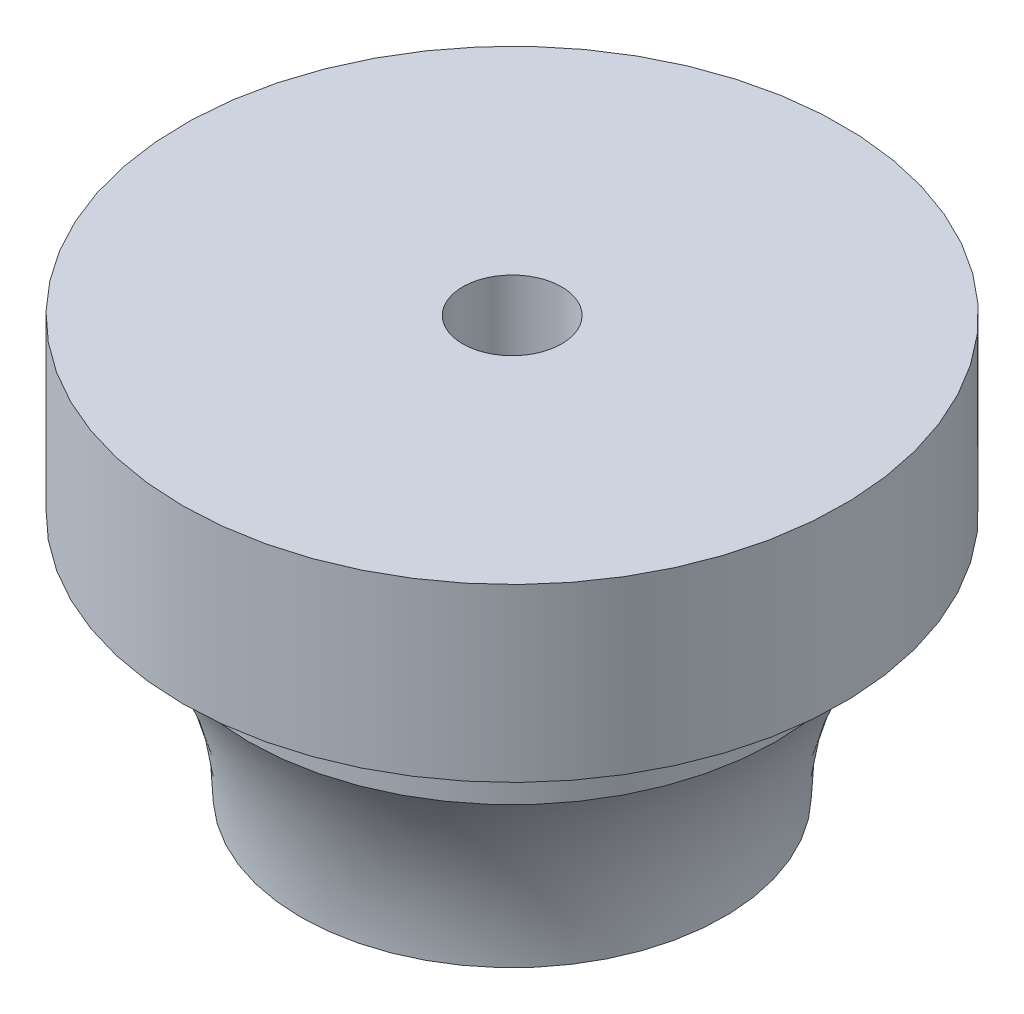
ISO-10303-21;
HEADER;
FILE_DESCRIPTION(('STEP AP214'),'2;1');
FILE_NAME('part.step','',(''),(''),'','','');
FILE_SCHEMA(('AUTOMOTIVE_DESIGN { 1 0 10303 214 1 1 1 1 }'));
ENDSEC;
DATA;
#1=APPLICATION_CONTEXT('core data for automotive mechanical design processes');
#2=APPLICATION_PROTOCOL_DEFINITION('international standard','automotive_design',2000,#1);
#3=PRODUCT_CONTEXT('',#1,'mechanical');
#4=PRODUCT('Part','Part','',(#3));
#5=PRODUCT_RELATED_PRODUCT_CATEGORY('part','',(#4));
#6=PRODUCT_DEFINITION_FORMATION('','',#4);
#7=PRODUCT_DEFINITION_CONTEXT('part definition',#1,'design');
#8=PRODUCT_DEFINITION('design','',#6,#7);
#9=PRODUCT_DEFINITION_SHAPE('','',#8);
#10=(LENGTH_UNIT() NAMED_UNIT(*) SI_UNIT(.MILLI.,.METRE.));
#11=(NAMED_UNIT(*) PLANE_ANGLE_UNIT() SI_UNIT($,.RADIAN.));
#12=(NAMED_UNIT(*) SI_UNIT($,.STERADIAN.) SOLID_ANGLE_UNIT());
#13=UNCERTAINTY_MEASURE_WITH_UNIT(LENGTH_MEASURE(1.E-05),#10,'distance_accuracy_value','');
#14=(GEOMETRIC_REPRESENTATION_CONTEXT(3) GLOBAL_UNCERTAINTY_ASSIGNED_CONTEXT((#13)) GLOBAL_UNIT_ASSIGNED_CONTEXT((#10,
#11,#12)) REPRESENTATION_CONTEXT('',''));
#15=CARTESIAN_POINT('',(0.,0.,0.));
#16=DIRECTION('',(0.,0.,1.));
#17=DIRECTION('',(1.,0.,0.));
#18=AXIS2_PLACEMENT_3D('',#15,#16,#17);
#19=CARTESIAN_POINT('',(0.,-0.63,0.));
#20=DIRECTION('',(0.,1.,0.));
#21=DIRECTION('',(0.,0.,1.));
#22=AXIS2_PLACEMENT_3D('',#19,#20,#21);
#23=CYLINDRICAL_SURFACE('',#22,8.);
#24=CARTESIAN_POINT('',(0.,5.40000000000015,0.));
#25=DIRECTION('',(0.,1.,0.));
#26=DIRECTION('',(1.,0.,0.));
#27=AXIS2_PLACEMENT_3D('',#24,#25,#26);
#28=CIRCLE('',#27,7.99999999999977);
#29=CARTESIAN_POINT('',(7.99999999999977,5.40000000000015,0.));
#30=VERTEX_POINT('',#29);
#31=EDGE_CURVE('E30',#30,#30,#28,.T.);
#32=ORIENTED_EDGE('',*,*,#31,.T.);
#33=EDGE_LOOP('',(#32));
#34=FACE_BOUND('',#33,.T.);
#35=CARTESIAN_POINT('',(0.,7.4,0.));
#36=DIRECTION('',(0.,1.,0.));
#37=DIRECTION('',(0.,0.,1.));
#38=AXIS2_PLACEMENT_3D('',#35,#36,#37);
#39=CIRCLE('',#38,8.);
#40=CARTESIAN_POINT('',(0.,7.4,8.));
#41=VERTEX_POINT('',#40);
#42=EDGE_CURVE('E18',#41,#41,#39,.F.);
#43=ORIENTED_EDGE('',*,*,#42,.T.);
#44=EDGE_LOOP('',(#43));
#45=FACE_BOUND('',#44,.T.);
#46=ADVANCED_FACE('F15',(#34,#45),#23,.T.);
#47=CARTESIAN_POINT('',(0.,0.,0.));
#48=DIRECTION('',(0.,1.,0.));
#49=DIRECTION('',(1.,0.,0.));
#50=AXIS2_PLACEMENT_3D('',#47,#48,#49);
#51=TOROIDAL_SURFACE('',#50,16.416650165,10.);
#52=ORIENTED_EDGE('',*,*,#31,.F.);
#53=EDGE_LOOP('',(#52));
#54=FACE_BOUND('',#53,.T.);
#55=CARTESIAN_POINT('',(0.,0.,0.));
#56=DIRECTION('',(0.,1.,0.));
#57=DIRECTION('',(0.,0.,1.));
#58=AXIS2_PLACEMENT_3D('',#55,#56,#57);
#59=CIRCLE('',#58,6.416650165);
#60=CARTESIAN_POINT('',(0.,0.,6.416650165));
#61=VERTEX_POINT('',#60);
#62=EDGE_CURVE('E37',#61,#61,#59,.T.);
#63=ORIENTED_EDGE('',*,*,#62,.T.);
#64=EDGE_LOOP('',(#63));
#65=FACE_BOUND('',#64,.T.);
#66=ADVANCED_FACE('F48',(#54,#65),#51,.F.);
#67=CARTESIAN_POINT('',(0.,7.4,0.));
#68=DIRECTION('',(0.,1.,0.));
#69=DIRECTION('',(0.,0.,1.));
#70=AXIS2_PLACEMENT_3D('',#67,#68,#69);
#71=PLANE('',#70);
#72=ORIENTED_EDGE('',*,*,#42,.F.);
#73=EDGE_LOOP('',(#72));
#74=FACE_BOUND('',#73,.T.);
#75=CARTESIAN_POINT('',(0.,7.4,0.));
#76=DIRECTION('',(0.,1.,0.));
#77=DIRECTION('',(0.,0.,1.));
#78=AXIS2_PLACEMENT_3D('',#75,#76,#77);
#79=CIRCLE('',#78,10.);
#80=CARTESIAN_POINT('',(0.,7.4,10.));
#81=VERTEX_POINT('',#80);
#82=EDGE_CURVE('E35',#81,#81,#79,.T.);
#83=ORIENTED_EDGE('',*,*,#82,.F.);
#84=EDGE_LOOP('',(#83));
#85=FACE_BOUND('',#84,.T.);
#86=ADVANCED_FACE('F50',(#74,#85),#71,.F.);
#87=CARTESIAN_POINT('',(0.,0.,0.));
#88=DIRECTION('',(0.,1.,0.));
#89=DIRECTION('',(0.,0.,1.));
#90=AXIS2_PLACEMENT_3D('',#87,#88,#89);
#91=PLANE('',#90);
#92=CARTESIAN_POINT('',(0.,0.,0.));
#93=DIRECTION('',(0.,1.,0.));
#94=DIRECTION('',(0.,0.,1.));
#95=AXIS2_PLACEMENT_3D('',#92,#93,#94);
#96=CIRCLE('',#95,1.5);
#97=CARTESIAN_POINT('',(0.,0.,1.5));
#98=VERTEX_POINT('',#97);
#99=EDGE_CURVE('E27',#98,#98,#96,.T.);
#100=ORIENTED_EDGE('',*,*,#99,.T.);
#101=EDGE_LOOP('',(#100));
#102=FACE_BOUND('',#101,.T.);
#103=ORIENTED_EDGE('',*,*,#62,.F.);
#104=EDGE_LOOP('',(#103));
#105=FACE_BOUND('',#104,.T.);
#106=ADVANCED_FACE('F56',(#102,#105),#91,.F.);
#107=CARTESIAN_POINT('',(0.,-0.63,0.));
#108=DIRECTION('',(0.,1.,0.));
#109=DIRECTION('',(0.,0.,1.));
#110=AXIS2_PLACEMENT_3D('',#107,#108,#109);
#111=CYLINDRICAL_SURFACE('',#110,10.);
#112=CARTESIAN_POINT('',(0.,12.6,0.));
#113=DIRECTION('',(0.,1.,0.));
#114=DIRECTION('',(0.,0.,1.));
#115=AXIS2_PLACEMENT_3D('',#112,#113,#114);
#116=CIRCLE('',#115,10.);
#117=CARTESIAN_POINT('',(0.,12.6,10.));
#118=VERTEX_POINT('',#117);
#119=EDGE_CURVE('E22',#118,#118,#116,.T.);
#120=ORIENTED_EDGE('',*,*,#119,.F.);
#121=EDGE_LOOP('',(#120));
#122=FACE_BOUND('',#121,.T.);
#123=ORIENTED_EDGE('',*,*,#82,.T.);
#124=EDGE_LOOP('',(#123));
#125=FACE_BOUND('',#124,.T.);
#126=ADVANCED_FACE('F66',(#122,#125),#111,.T.);
#127=CARTESIAN_POINT('',(0.,12.6,0.));
#128=DIRECTION('',(0.,1.,0.));
#129=DIRECTION('',(0.,0.,1.));
#130=AXIS2_PLACEMENT_3D('',#127,#128,#129);
#131=CYLINDRICAL_SURFACE('',#130,1.5);
#132=ORIENTED_EDGE('',*,*,#99,.F.);
#133=EDGE_LOOP('',(#132));
#134=FACE_BOUND('',#133,.T.);
#135=CARTESIAN_POINT('',(0.,12.6,0.));
#136=DIRECTION('',(0.,1.,0.));
#137=DIRECTION('',(0.,0.,1.));
#138=AXIS2_PLACEMENT_3D('',#135,#136,#137);
#139=CIRCLE('',#138,1.5);
#140=CARTESIAN_POINT('',(0.,12.6,1.5));
#141=VERTEX_POINT('',#140);
#142=EDGE_CURVE('E10',#141,#141,#139,.F.);
#143=ORIENTED_EDGE('',*,*,#142,.F.);
#144=EDGE_LOOP('',(#143));
#145=FACE_BOUND('',#144,.T.);
#146=ADVANCED_FACE('F61',(#134,#145),#131,.F.);
#147=CARTESIAN_POINT('',(0.,12.6,0.));
#148=DIRECTION('',(0.,1.,0.));
#149=DIRECTION('',(0.,0.,1.));
#150=AXIS2_PLACEMENT_3D('',#147,#148,#149);
#151=PLANE('',#150);
#152=ORIENTED_EDGE('',*,*,#142,.T.);
#153=EDGE_LOOP('',(#152));
#154=FACE_BOUND('',#153,.T.);
#155=ORIENTED_EDGE('',*,*,#119,.T.);
#156=EDGE_LOOP('',(#155));
#157=FACE_BOUND('',#156,.T.);
#158=ADVANCED_FACE('F59',(#154,#157),#151,.T.);
#159=CLOSED_SHELL('',(#46,#66,#86,#106,#126,#146,#158));
#160=MANIFOLD_SOLID_BREP('B1',#159);
#161=ADVANCED_BREP_SHAPE_REPRESENTATION('',(#18,#160),#14);
#162=SHAPE_DEFINITION_REPRESENTATION(#9,#161);
ENDSEC;
END-ISO-10303-21;
